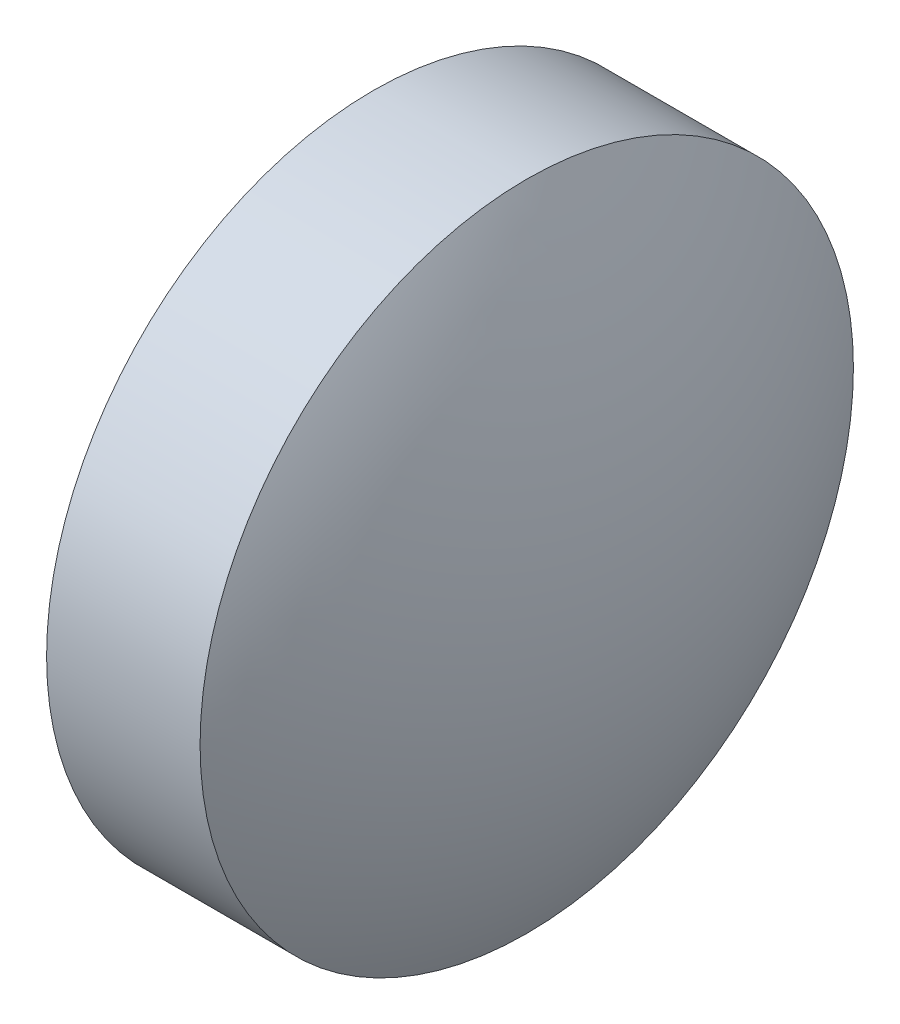
ISO-10303-21;
HEADER;
FILE_DESCRIPTION(('STEP AP214'),'2;1');
FILE_NAME('part.step','',(''),(''),'','','');
FILE_SCHEMA(('AUTOMOTIVE_DESIGN { 1 0 10303 214 1 1 1 1 }'));
ENDSEC;
DATA;
#1=APPLICATION_CONTEXT('core data for automotive mechanical design processes');
#2=APPLICATION_PROTOCOL_DEFINITION('international standard','automotive_design',2000,#1);
#3=PRODUCT_CONTEXT('',#1,'mechanical');
#4=PRODUCT('Part','Part','',(#3));
#5=PRODUCT_RELATED_PRODUCT_CATEGORY('part','',(#4));
#6=PRODUCT_DEFINITION_FORMATION('','',#4);
#7=PRODUCT_DEFINITION_CONTEXT('part definition',#1,'design');
#8=PRODUCT_DEFINITION('design','',#6,#7);
#9=PRODUCT_DEFINITION_SHAPE('','',#8);
#10=(LENGTH_UNIT() NAMED_UNIT(*) SI_UNIT(.MILLI.,.METRE.));
#11=(NAMED_UNIT(*) PLANE_ANGLE_UNIT() SI_UNIT($,.RADIAN.));
#12=(NAMED_UNIT(*) SI_UNIT($,.STERADIAN.) SOLID_ANGLE_UNIT());
#13=UNCERTAINTY_MEASURE_WITH_UNIT(LENGTH_MEASURE(1.E-05),#10,'distance_accuracy_value','');
#14=(GEOMETRIC_REPRESENTATION_CONTEXT(3) GLOBAL_UNCERTAINTY_ASSIGNED_CONTEXT((#13)) GLOBAL_UNIT_ASSIGNED_CONTEXT((#10,
#11,#12)) REPRESENTATION_CONTEXT('',''));
#15=CARTESIAN_POINT('',(0.,0.,0.));
#16=DIRECTION('',(0.,0.,1.));
#17=DIRECTION('',(1.,0.,0.));
#18=AXIS2_PLACEMENT_3D('',#15,#16,#17);
#19=CARTESIAN_POINT('',(506.832902702801,162.592259458134,0.));
#20=DIRECTION('',(-1.,0.,0.));
#21=DIRECTION('',(0.,1.,0.));
#22=AXIS2_PLACEMENT_3D('',#19,#20,#21);
#23=SPHERICAL_SURFACE('',#22,6.46030487804873);
#24=CARTESIAN_POINT('',(512.473207580849,162.592259458134,0.));
#25=DIRECTION('',(-1.,0.,0.));
#26=DIRECTION('',(0.,0.,1.));
#27=AXIS2_PLACEMENT_3D('',#24,#25,#26);
#28=CIRCLE('',#27,3.14999999999999);
#29=CARTESIAN_POINT('',(512.473207580849,162.592259458134,3.14999999999999));
#30=VERTEX_POINT('',#29);
#31=EDGE_CURVE('E10',#30,#30,#28,.T.);
#32=ORIENTED_EDGE('',*,*,#31,.F.);
#33=EDGE_LOOP('',(#32));
#34=FACE_BOUND('',#33,.T.);
#35=ADVANCED_FACE('F35',(#34),#23,.T.);
#36=CARTESIAN_POINT('',(492.776627744911,162.592259458134,0.));
#37=DIRECTION('',(-1.,0.,0.));
#38=DIRECTION('',(0.,0.,1.));
#39=AXIS2_PLACEMENT_3D('',#36,#37,#38);
#40=CYLINDRICAL_SURFACE('',#39,3.14999999999999);
#41=CARTESIAN_POINT('',(510.99320758085,162.592259458134,0.));
#42=DIRECTION('',(-1.,0.,0.));
#43=DIRECTION('',(0.,0.,1.));
#44=AXIS2_PLACEMENT_3D('',#41,#42,#43);
#45=CIRCLE('',#44,3.14999999999999);
#46=CARTESIAN_POINT('',(510.99320758085,162.592259458134,3.14999999999999));
#47=VERTEX_POINT('',#46);
#48=EDGE_CURVE('E41',#47,#47,#45,.T.);
#49=ORIENTED_EDGE('',*,*,#48,.F.);
#50=EDGE_LOOP('',(#49));
#51=FACE_BOUND('',#50,.T.);
#52=ORIENTED_EDGE('',*,*,#31,.T.);
#53=EDGE_LOOP('',(#52));
#54=FACE_BOUND('',#53,.T.);
#55=ADVANCED_FACE('F49',(#51,#54),#40,.T.);
#56=CARTESIAN_POINT('',(510.99320758085,162.592259458134,0.));
#57=DIRECTION('',(1.,0.,0.));
#58=DIRECTION('',(0.,0.,-1.));
#59=AXIS2_PLACEMENT_3D('',#56,#57,#58);
#60=PLANE('',#59);
#61=ORIENTED_EDGE('',*,*,#48,.T.);
#62=EDGE_LOOP('',(#61));
#63=FACE_BOUND('',#62,.T.);
#64=ADVANCED_FACE('F47',(#63),#60,.F.);
#65=CLOSED_SHELL('',(#35,#55,#64));
#66=MANIFOLD_SOLID_BREP('B2',#65);
#67=ADVANCED_BREP_SHAPE_REPRESENTATION('',(#18,#66),#14);
#68=SHAPE_DEFINITION_REPRESENTATION(#9,#67);
ENDSEC;
END-ISO-10303-21;
